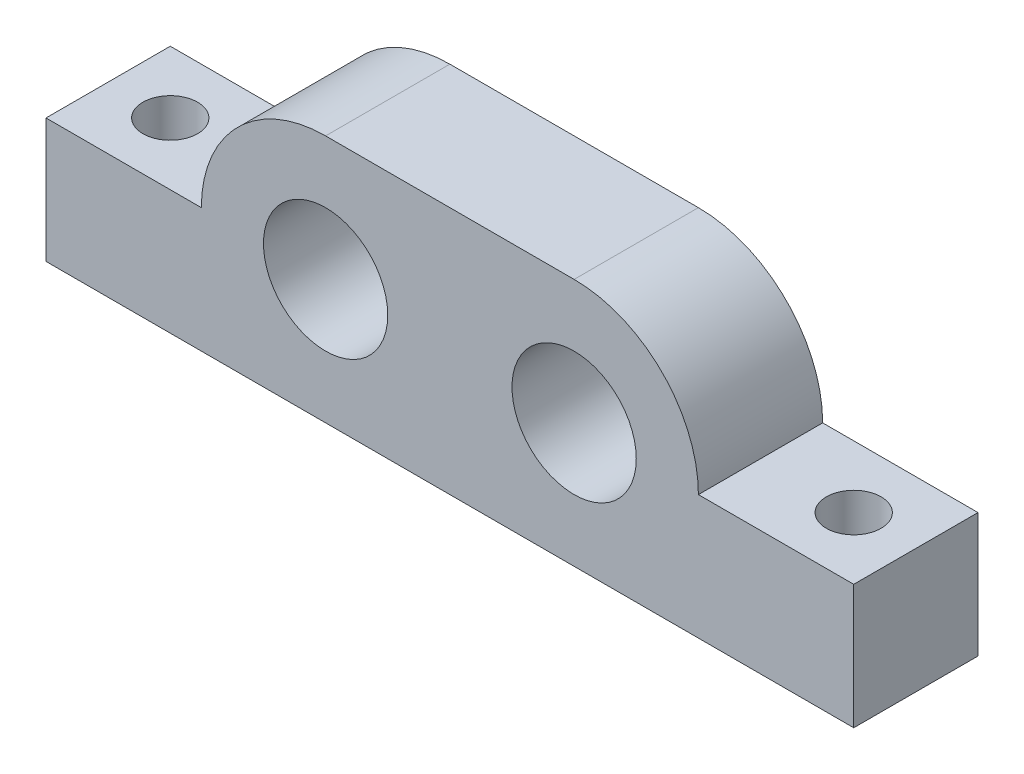
ISO-10303-21;
HEADER;
FILE_DESCRIPTION(('STEP AP214'),'2;1');
FILE_NAME('part.step','',(''),(''),'','','');
FILE_SCHEMA(('AUTOMOTIVE_DESIGN { 1 0 10303 214 1 1 1 1 }'));
ENDSEC;
DATA;
#1=APPLICATION_CONTEXT('core data for automotive mechanical design processes');
#2=APPLICATION_PROTOCOL_DEFINITION('international standard','automotive_design',2000,#1);
#3=PRODUCT_CONTEXT('',#1,'mechanical');
#4=PRODUCT('Part','Part','',(#3));
#5=PRODUCT_RELATED_PRODUCT_CATEGORY('part','',(#4));
#6=PRODUCT_DEFINITION_FORMATION('','',#4);
#7=PRODUCT_DEFINITION_CONTEXT('part definition',#1,'design');
#8=PRODUCT_DEFINITION('design','',#6,#7);
#9=PRODUCT_DEFINITION_SHAPE('','',#8);
#10=(LENGTH_UNIT() NAMED_UNIT(*) SI_UNIT(.MILLI.,.METRE.));
#11=(NAMED_UNIT(*) PLANE_ANGLE_UNIT() SI_UNIT($,.RADIAN.));
#12=(NAMED_UNIT(*) SI_UNIT($,.STERADIAN.) SOLID_ANGLE_UNIT());
#13=UNCERTAINTY_MEASURE_WITH_UNIT(LENGTH_MEASURE(1.E-05),#10,'distance_accuracy_value','');
#14=(GEOMETRIC_REPRESENTATION_CONTEXT(3) GLOBAL_UNCERTAINTY_ASSIGNED_CONTEXT((#13)) GLOBAL_UNIT_ASSIGNED_CONTEXT((#10,
#11,#12)) REPRESENTATION_CONTEXT('',''));
#15=CARTESIAN_POINT('',(0.,0.,0.));
#16=DIRECTION('',(0.,0.,1.));
#17=DIRECTION('',(1.,0.,0.));
#18=AXIS2_PLACEMENT_3D('',#15,#16,#17);
#19=CARTESIAN_POINT('',(14.2875,6.35,6.35));
#20=DIRECTION('',(0.,0.,-1.));
#21=DIRECTION('',(-1.,0.,0.));
#22=AXIS2_PLACEMENT_3D('',#19,#20,#21);
#23=PLANE('',#22);
#24=DIRECTION('',(0.,-1.,0.));
#25=VECTOR('',#24,1.);
#26=CARTESIAN_POINT('',(0.,0.,6.35));
#27=LINE('',#26,#25);
#28=CARTESIAN_POINT('',(0.,6.35,6.35));
#29=VERTEX_POINT('',#28);
#30=CARTESIAN_POINT('',(0.,0.,6.35));
#31=VERTEX_POINT('',#30);
#32=EDGE_CURVE('E146',#29,#31,#27,.T.);
#33=ORIENTED_EDGE('',*,*,#32,.T.);
#34=DIRECTION('',(1.,0.,0.));
#35=VECTOR('',#34,1.);
#36=CARTESIAN_POINT('',(0.,0.,6.35));
#37=LINE('',#36,#35);
#38=CARTESIAN_POINT('',(41.275,0.,6.35));
#39=VERTEX_POINT('',#38);
#40=EDGE_CURVE('E94',#31,#39,#37,.T.);
#41=ORIENTED_EDGE('',*,*,#40,.T.);
#42=DIRECTION('',(0.,1.,0.));
#43=VECTOR('',#42,1.);
#44=CARTESIAN_POINT('',(41.275,0.,6.35));
#45=LINE('',#44,#43);
#46=CARTESIAN_POINT('',(41.275,6.35,6.35));
#47=VERTEX_POINT('',#46);
#48=EDGE_CURVE('E161',#39,#47,#45,.T.);
#49=ORIENTED_EDGE('',*,*,#48,.T.);
#50=DIRECTION('',(-1.,0.,0.));
#51=VECTOR('',#50,1.);
#52=CARTESIAN_POINT('',(41.275,6.35,6.35));
#53=LINE('',#52,#51);
#54=CARTESIAN_POINT('',(33.3375,6.35,6.35));
#55=VERTEX_POINT('',#54);
#56=EDGE_CURVE('E174',#47,#55,#53,.T.);
#57=ORIENTED_EDGE('',*,*,#56,.T.);
#58=CARTESIAN_POINT('',(26.9875,6.35,6.35));
#59=DIRECTION('',(0.,0.,1.));
#60=DIRECTION('',(1.,0.,0.));
#61=AXIS2_PLACEMENT_3D('',#58,#59,#60);
#62=CIRCLE('',#61,6.35);
#63=CARTESIAN_POINT('',(26.9875,12.7,6.35));
#64=VERTEX_POINT('',#63);
#65=EDGE_CURVE('E113',#55,#64,#62,.T.);
#66=ORIENTED_EDGE('',*,*,#65,.T.);
#67=DIRECTION('',(-1.,0.,0.));
#68=VECTOR('',#67,1.);
#69=CARTESIAN_POINT('',(14.2875,12.7,6.35));
#70=LINE('',#69,#68);
#71=CARTESIAN_POINT('',(14.2875,12.7,6.35));
#72=VERTEX_POINT('',#71);
#73=EDGE_CURVE('E107',#64,#72,#70,.T.);
#74=ORIENTED_EDGE('',*,*,#73,.T.);
#75=CARTESIAN_POINT('',(14.2875,6.35,6.35));
#76=DIRECTION('',(0.,0.,1.));
#77=DIRECTION('',(-1.,0.,0.));
#78=AXIS2_PLACEMENT_3D('',#75,#76,#77);
#79=CIRCLE('',#78,6.35);
#80=CARTESIAN_POINT('',(7.9375,6.35,6.35));
#81=VERTEX_POINT('',#80);
#82=EDGE_CURVE('E111',#72,#81,#79,.T.);
#83=ORIENTED_EDGE('',*,*,#82,.T.);
#84=DIRECTION('',(-1.,0.,0.));
#85=VECTOR('',#84,1.);
#86=CARTESIAN_POINT('',(0.,6.35,6.35));
#87=LINE('',#86,#85);
#88=EDGE_CURVE('E51',#81,#29,#87,.T.);
#89=ORIENTED_EDGE('',*,*,#88,.T.);
#90=EDGE_LOOP('',(#33,#41,#49,#57,#66,#74,#83,#89));
#91=FACE_BOUND('',#90,.T.);
#92=CARTESIAN_POINT('',(26.9875,6.35,6.35));
#93=DIRECTION('',(0.,0.,1.));
#94=DIRECTION('',(1.,0.,0.));
#95=AXIS2_PLACEMENT_3D('',#92,#93,#94);
#96=CIRCLE('',#95,3.17500000000001);
#97=CARTESIAN_POINT('',(30.1625,6.35,6.35));
#98=VERTEX_POINT('',#97);
#99=EDGE_CURVE('E135',#98,#98,#96,.T.);
#100=ORIENTED_EDGE('',*,*,#99,.F.);
#101=EDGE_LOOP('',(#100));
#102=FACE_BOUND('',#101,.T.);
#103=CARTESIAN_POINT('',(14.2875,6.35,6.35));
#104=DIRECTION('',(0.,0.,1.));
#105=DIRECTION('',(1.,0.,0.));
#106=AXIS2_PLACEMENT_3D('',#103,#104,#105);
#107=CIRCLE('',#106,3.17500000000001);
#108=CARTESIAN_POINT('',(17.4625,6.35,6.35));
#109=VERTEX_POINT('',#108);
#110=EDGE_CURVE('E183',#109,#109,#107,.T.);
#111=ORIENTED_EDGE('',*,*,#110,.F.);
#112=EDGE_LOOP('',(#111));
#113=FACE_BOUND('',#112,.T.);
#114=ADVANCED_FACE('F34',(#91,#102,#113),#23,.F.);
#115=CARTESIAN_POINT('',(14.2875,6.35,0.));
#116=DIRECTION('',(0.,0.,-1.));
#117=DIRECTION('',(-1.,0.,0.));
#118=AXIS2_PLACEMENT_3D('',#115,#116,#117);
#119=PLANE('',#118);
#120=CARTESIAN_POINT('',(26.9875,6.35,0.));
#121=DIRECTION('',(0.,0.,1.));
#122=DIRECTION('',(1.,0.,0.));
#123=AXIS2_PLACEMENT_3D('',#120,#121,#122);
#124=CIRCLE('',#123,3.17500000000001);
#125=CARTESIAN_POINT('',(30.1625,6.35,0.));
#126=VERTEX_POINT('',#125);
#127=EDGE_CURVE('E180',#126,#126,#124,.T.);
#128=ORIENTED_EDGE('',*,*,#127,.T.);
#129=EDGE_LOOP('',(#128));
#130=FACE_BOUND('',#129,.T.);
#131=DIRECTION('',(0.,-1.,0.));
#132=VECTOR('',#131,1.);
#133=CARTESIAN_POINT('',(0.,0.,0.));
#134=LINE('',#133,#132);
#135=CARTESIAN_POINT('',(0.,6.35,0.));
#136=VERTEX_POINT('',#135);
#137=CARTESIAN_POINT('',(0.,0.,0.));
#138=VERTEX_POINT('',#137);
#139=EDGE_CURVE('E131',#136,#138,#134,.T.);
#140=ORIENTED_EDGE('',*,*,#139,.F.);
#141=DIRECTION('',(-1.,0.,0.));
#142=VECTOR('',#141,1.);
#143=CARTESIAN_POINT('',(0.,6.35,0.));
#144=LINE('',#143,#142);
#145=CARTESIAN_POINT('',(7.9375,6.35,0.));
#146=VERTEX_POINT('',#145);
#147=EDGE_CURVE('E86',#146,#136,#144,.T.);
#148=ORIENTED_EDGE('',*,*,#147,.F.);
#149=CARTESIAN_POINT('',(14.2875,6.35,0.));
#150=DIRECTION('',(0.,0.,1.));
#151=DIRECTION('',(-1.,0.,0.));
#152=AXIS2_PLACEMENT_3D('',#149,#150,#151);
#153=CIRCLE('',#152,6.35);
#154=CARTESIAN_POINT('',(14.2875,12.7,0.));
#155=VERTEX_POINT('',#154);
#156=EDGE_CURVE('E80',#155,#146,#153,.T.);
#157=ORIENTED_EDGE('',*,*,#156,.F.);
#158=DIRECTION('',(-1.,0.,0.));
#159=VECTOR('',#158,1.);
#160=CARTESIAN_POINT('',(14.2875,12.7,0.));
#161=LINE('',#160,#159);
#162=CARTESIAN_POINT('',(26.9875,12.7,0.));
#163=VERTEX_POINT('',#162);
#164=EDGE_CURVE('E121',#163,#155,#161,.T.);
#165=ORIENTED_EDGE('',*,*,#164,.F.);
#166=CARTESIAN_POINT('',(26.9875,6.35,0.));
#167=DIRECTION('',(0.,0.,1.));
#168=DIRECTION('',(1.,0.,0.));
#169=AXIS2_PLACEMENT_3D('',#166,#167,#168);
#170=CIRCLE('',#169,6.35);
#171=CARTESIAN_POINT('',(33.3375,6.35,0.));
#172=VERTEX_POINT('',#171);
#173=EDGE_CURVE('E141',#172,#163,#170,.T.);
#174=ORIENTED_EDGE('',*,*,#173,.F.);
#175=DIRECTION('',(-1.,0.,0.));
#176=VECTOR('',#175,1.);
#177=CARTESIAN_POINT('',(41.275,6.35,0.));
#178=LINE('',#177,#176);
#179=CARTESIAN_POINT('',(41.275,6.35,0.));
#180=VERTEX_POINT('',#179);
#181=EDGE_CURVE('E139',#180,#172,#178,.T.);
#182=ORIENTED_EDGE('',*,*,#181,.F.);
#183=DIRECTION('',(0.,1.,0.));
#184=VECTOR('',#183,1.);
#185=CARTESIAN_POINT('',(41.275,0.,0.));
#186=LINE('',#185,#184);
#187=CARTESIAN_POINT('',(41.275,0.,0.));
#188=VERTEX_POINT('',#187);
#189=EDGE_CURVE('E137',#188,#180,#186,.T.);
#190=ORIENTED_EDGE('',*,*,#189,.F.);
#191=DIRECTION('',(1.,0.,0.));
#192=VECTOR('',#191,1.);
#193=CARTESIAN_POINT('',(0.,0.,0.));
#194=LINE('',#193,#192);
#195=EDGE_CURVE('E134',#138,#188,#194,.T.);
#196=ORIENTED_EDGE('',*,*,#195,.F.);
#197=EDGE_LOOP('',(#140,#148,#157,#165,#174,#182,#190,#196));
#198=FACE_BOUND('',#197,.T.);
#199=CARTESIAN_POINT('',(14.2875,6.35,0.));
#200=DIRECTION('',(0.,0.,1.));
#201=DIRECTION('',(1.,0.,0.));
#202=AXIS2_PLACEMENT_3D('',#199,#200,#201);
#203=CIRCLE('',#202,3.17500000000001);
#204=CARTESIAN_POINT('',(17.4625,6.35,0.));
#205=VERTEX_POINT('',#204);
#206=EDGE_CURVE('E186',#205,#205,#203,.T.);
#207=ORIENTED_EDGE('',*,*,#206,.T.);
#208=EDGE_LOOP('',(#207));
#209=FACE_BOUND('',#208,.T.);
#210=ADVANCED_FACE('F165',(#130,#198,#209),#119,.T.);
#211=CARTESIAN_POINT('',(0.,0.,6.35));
#212=DIRECTION('',(1.,0.,0.));
#213=DIRECTION('',(0.,0.,-1.));
#214=AXIS2_PLACEMENT_3D('',#211,#212,#213);
#215=PLANE('',#214);
#216=ORIENTED_EDGE('',*,*,#139,.T.);
#217=DIRECTION('',(0.,0.,-1.));
#218=VECTOR('',#217,1.);
#219=CARTESIAN_POINT('',(0.,0.,6.35));
#220=LINE('',#219,#218);
#221=EDGE_CURVE('E11',#31,#138,#220,.T.);
#222=ORIENTED_EDGE('',*,*,#221,.F.);
#223=ORIENTED_EDGE('',*,*,#32,.F.);
#224=DIRECTION('',(0.,0.,-1.));
#225=VECTOR('',#224,1.);
#226=CARTESIAN_POINT('',(0.,6.35,6.35));
#227=LINE('',#226,#225);
#228=EDGE_CURVE('E127',#29,#136,#227,.T.);
#229=ORIENTED_EDGE('',*,*,#228,.T.);
#230=EDGE_LOOP('',(#216,#222,#223,#229));
#231=FACE_BOUND('',#230,.T.);
#232=ADVANCED_FACE('F36',(#231),#215,.F.);
#233=CARTESIAN_POINT('',(0.,0.,6.35));
#234=DIRECTION('',(0.,1.,0.));
#235=DIRECTION('',(0.,0.,1.));
#236=AXIS2_PLACEMENT_3D('',#233,#234,#235);
#237=PLANE('',#236);
#238=CARTESIAN_POINT('',(38.1,0.,3.175));
#239=DIRECTION('',(0.,1.,0.));
#240=DIRECTION('',(0.,0.,1.));
#241=AXIS2_PLACEMENT_3D('',#238,#239,#240);
#242=CIRCLE('',#241,1.39700000000001);
#243=CARTESIAN_POINT('',(38.1,0.,4.572));
#244=VERTEX_POINT('',#243);
#245=EDGE_CURVE('E189',#244,#244,#242,.F.);
#246=ORIENTED_EDGE('',*,*,#245,.F.);
#247=EDGE_LOOP('',(#246));
#248=FACE_BOUND('',#247,.T.);
#249=CARTESIAN_POINT('',(3.175,0.,3.175));
#250=DIRECTION('',(0.,1.,0.));
#251=DIRECTION('',(0.,0.,1.));
#252=AXIS2_PLACEMENT_3D('',#249,#250,#251);
#253=CIRCLE('',#252,1.397);
#254=CARTESIAN_POINT('',(3.175,0.,4.572));
#255=VERTEX_POINT('',#254);
#256=EDGE_CURVE('E192',#255,#255,#253,.F.);
#257=ORIENTED_EDGE('',*,*,#256,.F.);
#258=EDGE_LOOP('',(#257));
#259=FACE_BOUND('',#258,.T.);
#260=ORIENTED_EDGE('',*,*,#195,.T.);
#261=DIRECTION('',(0.,0.,-1.));
#262=VECTOR('',#261,1.);
#263=CARTESIAN_POINT('',(41.275,0.,6.35));
#264=LINE('',#263,#262);
#265=EDGE_CURVE('E43',#39,#188,#264,.T.);
#266=ORIENTED_EDGE('',*,*,#265,.F.);
#267=ORIENTED_EDGE('',*,*,#40,.F.);
#268=ORIENTED_EDGE('',*,*,#221,.T.);
#269=EDGE_LOOP('',(#260,#266,#267,#268));
#270=FACE_BOUND('',#269,.T.);
#271=ADVANCED_FACE('F214',(#248,#259,#270),#237,.F.);
#272=CARTESIAN_POINT('',(41.275,0.,6.35));
#273=DIRECTION('',(-1.,0.,0.));
#274=DIRECTION('',(0.,0.,1.));
#275=AXIS2_PLACEMENT_3D('',#272,#273,#274);
#276=PLANE('',#275);
#277=ORIENTED_EDGE('',*,*,#189,.T.);
#278=DIRECTION('',(0.,0.,-1.));
#279=VECTOR('',#278,1.);
#280=CARTESIAN_POINT('',(41.275,6.35,6.35));
#281=LINE('',#280,#279);
#282=EDGE_CURVE('E153',#47,#180,#281,.T.);
#283=ORIENTED_EDGE('',*,*,#282,.F.);
#284=ORIENTED_EDGE('',*,*,#48,.F.);
#285=ORIENTED_EDGE('',*,*,#265,.T.);
#286=EDGE_LOOP('',(#277,#283,#284,#285));
#287=FACE_BOUND('',#286,.T.);
#288=ADVANCED_FACE('F159',(#287),#276,.F.);
#289=CARTESIAN_POINT('',(41.275,6.35,6.35));
#290=DIRECTION('',(0.,-1.,0.));
#291=DIRECTION('',(0.,0.,-1.));
#292=AXIS2_PLACEMENT_3D('',#289,#290,#291);
#293=PLANE('',#292);
#294=CARTESIAN_POINT('',(38.1,6.35,3.175));
#295=DIRECTION('',(0.,1.,0.));
#296=DIRECTION('',(0.,0.,1.));
#297=AXIS2_PLACEMENT_3D('',#294,#295,#296);
#298=CIRCLE('',#297,1.39700000000001);
#299=CARTESIAN_POINT('',(38.1,6.35,4.572));
#300=VERTEX_POINT('',#299);
#301=EDGE_CURVE('E195',#300,#300,#298,.T.);
#302=ORIENTED_EDGE('',*,*,#301,.F.);
#303=EDGE_LOOP('',(#302));
#304=FACE_BOUND('',#303,.T.);
#305=ORIENTED_EDGE('',*,*,#181,.T.);
#306=DIRECTION('',(0.,0.,-1.));
#307=VECTOR('',#306,1.);
#308=CARTESIAN_POINT('',(33.3375,6.35,6.35));
#309=LINE('',#308,#307);
#310=EDGE_CURVE('E150',#55,#172,#309,.T.);
#311=ORIENTED_EDGE('',*,*,#310,.F.);
#312=ORIENTED_EDGE('',*,*,#56,.F.);
#313=ORIENTED_EDGE('',*,*,#282,.T.);
#314=EDGE_LOOP('',(#305,#311,#312,#313));
#315=FACE_BOUND('',#314,.T.);
#316=ADVANCED_FACE('F170',(#304,#315),#293,.F.);
#317=CARTESIAN_POINT('',(26.9875,6.35,6.35));
#318=DIRECTION('',(0.,0.,-1.));
#319=DIRECTION('',(-1.,0.,0.));
#320=AXIS2_PLACEMENT_3D('',#317,#318,#319);
#321=CYLINDRICAL_SURFACE('',#320,6.35);
#322=ORIENTED_EDGE('',*,*,#173,.T.);
#323=DIRECTION('',(0.,0.,-1.));
#324=VECTOR('',#323,1.);
#325=CARTESIAN_POINT('',(26.9875,12.7,6.35));
#326=LINE('',#325,#324);
#327=EDGE_CURVE('E122',#64,#163,#326,.T.);
#328=ORIENTED_EDGE('',*,*,#327,.F.);
#329=ORIENTED_EDGE('',*,*,#65,.F.);
#330=ORIENTED_EDGE('',*,*,#310,.T.);
#331=EDGE_LOOP('',(#322,#328,#329,#330));
#332=FACE_BOUND('',#331,.T.);
#333=ADVANCED_FACE('F173',(#332),#321,.T.);
#334=CARTESIAN_POINT('',(14.2875,12.7,6.35));
#335=DIRECTION('',(0.,-1.,0.));
#336=DIRECTION('',(0.,0.,-1.));
#337=AXIS2_PLACEMENT_3D('',#334,#335,#336);
#338=PLANE('',#337);
#339=ORIENTED_EDGE('',*,*,#164,.T.);
#340=DIRECTION('',(0.,0.,-1.));
#341=VECTOR('',#340,1.);
#342=CARTESIAN_POINT('',(14.2875,12.7,6.35));
#343=LINE('',#342,#341);
#344=EDGE_CURVE('E118',#72,#155,#343,.T.);
#345=ORIENTED_EDGE('',*,*,#344,.F.);
#346=ORIENTED_EDGE('',*,*,#73,.F.);
#347=ORIENTED_EDGE('',*,*,#327,.T.);
#348=EDGE_LOOP('',(#339,#345,#346,#347));
#349=FACE_BOUND('',#348,.T.);
#350=ADVANCED_FACE('F119',(#349),#338,.F.);
#351=CARTESIAN_POINT('',(14.2875,6.35,6.35));
#352=DIRECTION('',(0.,0.,-1.));
#353=DIRECTION('',(-1.,0.,0.));
#354=AXIS2_PLACEMENT_3D('',#351,#352,#353);
#355=CYLINDRICAL_SURFACE('',#354,6.35);
#356=ORIENTED_EDGE('',*,*,#156,.T.);
#357=DIRECTION('',(0.,0.,-1.));
#358=VECTOR('',#357,1.);
#359=CARTESIAN_POINT('',(7.9375,6.35,6.35));
#360=LINE('',#359,#358);
#361=EDGE_CURVE('E123',#81,#146,#360,.T.);
#362=ORIENTED_EDGE('',*,*,#361,.F.);
#363=ORIENTED_EDGE('',*,*,#82,.F.);
#364=ORIENTED_EDGE('',*,*,#344,.T.);
#365=EDGE_LOOP('',(#356,#362,#363,#364));
#366=FACE_BOUND('',#365,.T.);
#367=ADVANCED_FACE('F125',(#366),#355,.T.);
#368=CARTESIAN_POINT('',(0.,6.35,6.35));
#369=DIRECTION('',(0.,-1.,0.));
#370=DIRECTION('',(0.,0.,-1.));
#371=AXIS2_PLACEMENT_3D('',#368,#369,#370);
#372=PLANE('',#371);
#373=CARTESIAN_POINT('',(3.175,6.35,3.175));
#374=DIRECTION('',(0.,1.,0.));
#375=DIRECTION('',(0.,0.,1.));
#376=AXIS2_PLACEMENT_3D('',#373,#374,#375);
#377=CIRCLE('',#376,1.397);
#378=CARTESIAN_POINT('',(3.175,6.35,4.572));
#379=VERTEX_POINT('',#378);
#380=EDGE_CURVE('E196',#379,#379,#377,.T.);
#381=ORIENTED_EDGE('',*,*,#380,.F.);
#382=EDGE_LOOP('',(#381));
#383=FACE_BOUND('',#382,.T.);
#384=ORIENTED_EDGE('',*,*,#147,.T.);
#385=ORIENTED_EDGE('',*,*,#228,.F.);
#386=ORIENTED_EDGE('',*,*,#88,.F.);
#387=ORIENTED_EDGE('',*,*,#361,.T.);
#388=EDGE_LOOP('',(#384,#385,#386,#387));
#389=FACE_BOUND('',#388,.T.);
#390=ADVANCED_FACE('F227',(#383,#389),#372,.F.);
#391=CARTESIAN_POINT('',(26.9875,6.35,6.35));
#392=DIRECTION('',(0.,0.,-1.));
#393=DIRECTION('',(-1.,0.,0.));
#394=AXIS2_PLACEMENT_3D('',#391,#392,#393);
#395=CYLINDRICAL_SURFACE('',#394,3.17500000000001);
#396=ORIENTED_EDGE('',*,*,#99,.T.);
#397=EDGE_LOOP('',(#396));
#398=FACE_BOUND('',#397,.T.);
#399=ORIENTED_EDGE('',*,*,#127,.F.);
#400=EDGE_LOOP('',(#399));
#401=FACE_BOUND('',#400,.T.);
#402=ADVANCED_FACE('F224',(#398,#401),#395,.F.);
#403=CARTESIAN_POINT('',(14.2875,6.35,6.35));
#404=DIRECTION('',(0.,0.,-1.));
#405=DIRECTION('',(-1.,0.,0.));
#406=AXIS2_PLACEMENT_3D('',#403,#404,#405);
#407=CYLINDRICAL_SURFACE('',#406,3.17500000000001);
#408=ORIENTED_EDGE('',*,*,#110,.T.);
#409=EDGE_LOOP('',(#408));
#410=FACE_BOUND('',#409,.T.);
#411=ORIENTED_EDGE('',*,*,#206,.F.);
#412=EDGE_LOOP('',(#411));
#413=FACE_BOUND('',#412,.T.);
#414=ADVANCED_FACE('F253',(#410,#413),#407,.F.);
#415=CARTESIAN_POINT('',(3.175,-0.00100000000000013,3.175));
#416=DIRECTION('',(0.,1.,0.));
#417=DIRECTION('',(0.,0.,1.));
#418=AXIS2_PLACEMENT_3D('',#415,#416,#417);
#419=CYLINDRICAL_SURFACE('',#418,1.397);
#420=ORIENTED_EDGE('',*,*,#380,.T.);
#421=EDGE_LOOP('',(#420));
#422=FACE_BOUND('',#421,.T.);
#423=ORIENTED_EDGE('',*,*,#256,.T.);
#424=EDGE_LOOP('',(#423));
#425=FACE_BOUND('',#424,.T.);
#426=ADVANCED_FACE('F260',(#422,#425),#419,.F.);
#427=CARTESIAN_POINT('',(38.1,-0.00100000000000013,3.175));
#428=DIRECTION('',(0.,1.,0.));
#429=DIRECTION('',(0.,0.,1.));
#430=AXIS2_PLACEMENT_3D('',#427,#428,#429);
#431=CYLINDRICAL_SURFACE('',#430,1.39700000000001);
#432=ORIENTED_EDGE('',*,*,#301,.T.);
#433=EDGE_LOOP('',(#432));
#434=FACE_BOUND('',#433,.T.);
#435=ORIENTED_EDGE('',*,*,#245,.T.);
#436=EDGE_LOOP('',(#435));
#437=FACE_BOUND('',#436,.T.);
#438=ADVANCED_FACE('F204',(#434,#437),#431,.F.);
#439=CLOSED_SHELL('',(#114,#210,#232,#271,#288,#316,#333,#350,#367,#390,#402,#414,#426,#438));
#440=MANIFOLD_SOLID_BREP('B2',#439);
#441=ADVANCED_BREP_SHAPE_REPRESENTATION('',(#18,#440),#14);
#442=SHAPE_DEFINITION_REPRESENTATION(#9,#441);
ENDSEC;
END-ISO-10303-21;
